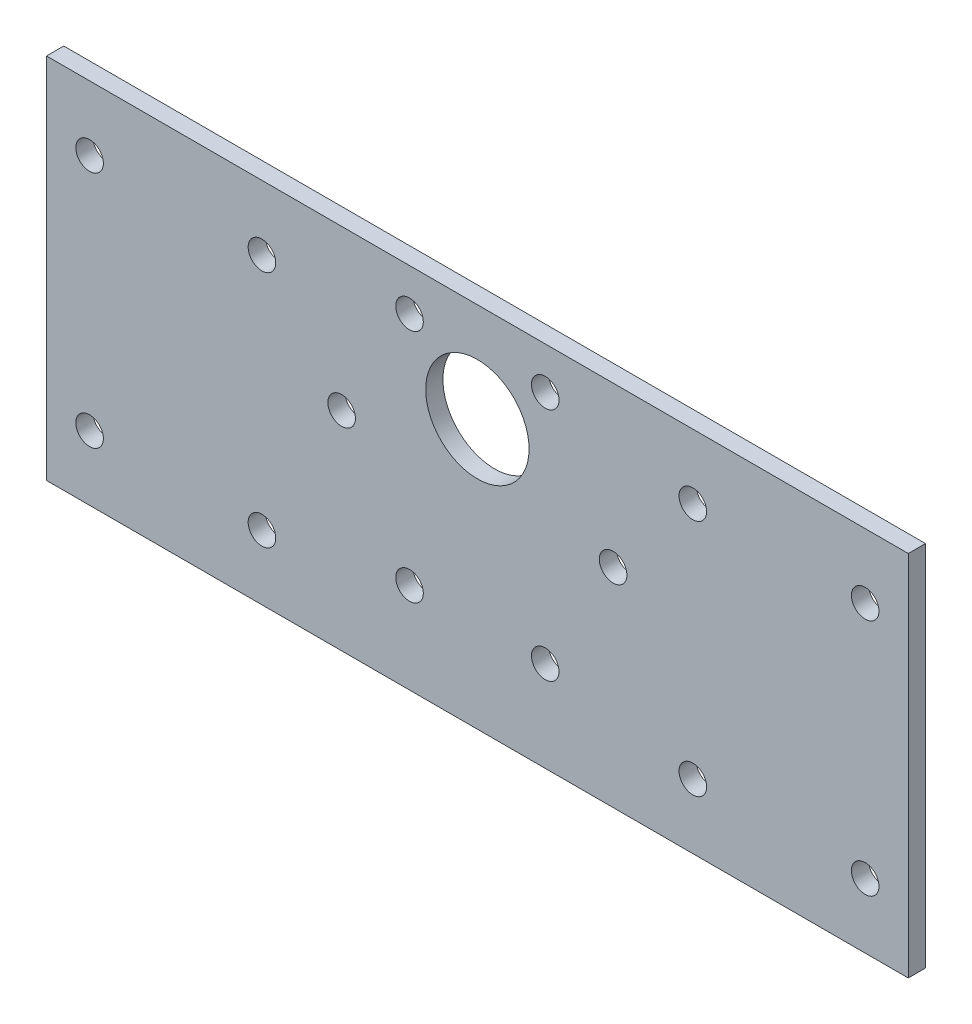
ISO-10303-21;
HEADER;
FILE_DESCRIPTION(('STEP AP214'),'2;1');
FILE_NAME('part.step','',(''),(''),'','','');
FILE_SCHEMA(('AUTOMOTIVE_DESIGN { 1 0 10303 214 1 1 1 1 }'));
ENDSEC;
DATA;
#1=APPLICATION_CONTEXT('core data for automotive mechanical design processes');
#2=APPLICATION_PROTOCOL_DEFINITION('international standard','automotive_design',2000,#1);
#3=PRODUCT_CONTEXT('',#1,'mechanical');
#4=PRODUCT('Part','Part','',(#3));
#5=PRODUCT_RELATED_PRODUCT_CATEGORY('part','',(#4));
#6=PRODUCT_DEFINITION_FORMATION('','',#4);
#7=PRODUCT_DEFINITION_CONTEXT('part definition',#1,'design');
#8=PRODUCT_DEFINITION('design','',#6,#7);
#9=PRODUCT_DEFINITION_SHAPE('','',#8);
#10=(LENGTH_UNIT() NAMED_UNIT(*) SI_UNIT(.MILLI.,.METRE.));
#11=(NAMED_UNIT(*) PLANE_ANGLE_UNIT() SI_UNIT($,.RADIAN.));
#12=(NAMED_UNIT(*) SI_UNIT($,.STERADIAN.) SOLID_ANGLE_UNIT());
#13=UNCERTAINTY_MEASURE_WITH_UNIT(LENGTH_MEASURE(1.E-05),#10,'distance_accuracy_value','');
#14=(GEOMETRIC_REPRESENTATION_CONTEXT(3) GLOBAL_UNCERTAINTY_ASSIGNED_CONTEXT((#13)) GLOBAL_UNIT_ASSIGNED_CONTEXT((#10,
#11,#12)) REPRESENTATION_CONTEXT('',''));
#15=CARTESIAN_POINT('',(0.,0.,0.));
#16=DIRECTION('',(0.,0.,1.));
#17=DIRECTION('',(1.,0.,0.));
#18=AXIS2_PLACEMENT_3D('',#15,#16,#17);
#19=CARTESIAN_POINT('',(-50.,0.,2.));
#20=DIRECTION('',(1.,0.,0.));
#21=DIRECTION('',(0.,1.,0.));
#22=AXIS2_PLACEMENT_3D('',#19,#20,#21);
#23=PLANE('',#22);
#24=DIRECTION('',(0.,0.,-1.));
#25=VECTOR('',#24,1.);
#26=CARTESIAN_POINT('',(-50.,-17.66,2.));
#27=LINE('',#26,#25);
#28=CARTESIAN_POINT('',(-50.,-17.66,2.));
#29=VERTEX_POINT('',#28);
#30=CARTESIAN_POINT('',(-50.,-17.66,0.));
#31=VERTEX_POINT('',#30);
#32=EDGE_CURVE('E196',#29,#31,#27,.T.);
#33=ORIENTED_EDGE('',*,*,#32,.F.);
#34=DIRECTION('',(0.,-1.,0.));
#35=VECTOR('',#34,1.);
#36=CARTESIAN_POINT('',(-50.,0.,2.));
#37=LINE('',#36,#35);
#38=CARTESIAN_POINT('',(-50.,25.,2.));
#39=VERTEX_POINT('',#38);
#40=EDGE_CURVE('E104',#39,#29,#37,.T.);
#41=ORIENTED_EDGE('',*,*,#40,.F.);
#42=DIRECTION('',(0.,0.,-1.));
#43=VECTOR('',#42,1.);
#44=CARTESIAN_POINT('',(-50.,25.,2.));
#45=LINE('',#44,#43);
#46=CARTESIAN_POINT('',(-50.,25.,0.));
#47=VERTEX_POINT('',#46);
#48=EDGE_CURVE('E73',#39,#47,#45,.T.);
#49=ORIENTED_EDGE('',*,*,#48,.T.);
#50=DIRECTION('',(0.,-1.,0.));
#51=VECTOR('',#50,1.);
#52=CARTESIAN_POINT('',(-50.,0.,0.));
#53=LINE('',#52,#51);
#54=EDGE_CURVE('E102',#47,#31,#53,.T.);
#55=ORIENTED_EDGE('',*,*,#54,.T.);
#56=EDGE_LOOP('',(#33,#41,#49,#55));
#57=FACE_BOUND('',#56,.T.);
#58=ADVANCED_FACE('F65',(#57),#23,.F.);
#59=CARTESIAN_POINT('',(50.,0.,2.));
#60=DIRECTION('',(1.,0.,0.));
#61=DIRECTION('',(0.,1.,0.));
#62=AXIS2_PLACEMENT_3D('',#59,#60,#61);
#63=PLANE('',#62);
#64=DIRECTION('',(0.,-1.,0.));
#65=VECTOR('',#64,1.);
#66=CARTESIAN_POINT('',(50.,0.,2.));
#67=LINE('',#66,#65);
#68=CARTESIAN_POINT('',(50.,25.,2.));
#69=VERTEX_POINT('',#68);
#70=CARTESIAN_POINT('',(50.,-17.66,2.));
#71=VERTEX_POINT('',#70);
#72=EDGE_CURVE('E131',#69,#71,#67,.T.);
#73=ORIENTED_EDGE('',*,*,#72,.T.);
#74=DIRECTION('',(0.,0.,1.));
#75=VECTOR('',#74,1.);
#76=CARTESIAN_POINT('',(50.,-17.66,2.));
#77=LINE('',#76,#75);
#78=CARTESIAN_POINT('',(50.,-17.66,0.));
#79=VERTEX_POINT('',#78);
#80=EDGE_CURVE('E80',#79,#71,#77,.T.);
#81=ORIENTED_EDGE('',*,*,#80,.F.);
#82=DIRECTION('',(0.,-1.,0.));
#83=VECTOR('',#82,1.);
#84=CARTESIAN_POINT('',(50.,0.,0.));
#85=LINE('',#84,#83);
#86=CARTESIAN_POINT('',(50.,25.,0.));
#87=VERTEX_POINT('',#86);
#88=EDGE_CURVE('E117',#87,#79,#85,.T.);
#89=ORIENTED_EDGE('',*,*,#88,.F.);
#90=DIRECTION('',(0.,0.,-1.));
#91=VECTOR('',#90,1.);
#92=CARTESIAN_POINT('',(50.,25.,2.));
#93=LINE('',#92,#91);
#94=EDGE_CURVE('E12',#69,#87,#93,.T.);
#95=ORIENTED_EDGE('',*,*,#94,.F.);
#96=EDGE_LOOP('',(#73,#81,#89,#95));
#97=FACE_BOUND('',#96,.T.);
#98=ADVANCED_FACE('F262',(#97),#63,.T.);
#99=CARTESIAN_POINT('',(0.,0.,0.));
#100=DIRECTION('',(0.,0.,1.));
#101=DIRECTION('',(1.,0.,0.));
#102=AXIS2_PLACEMENT_3D('',#99,#100,#101);
#103=PLANE('',#102);
#104=CARTESIAN_POINT('',(45.,17.5,0.));
#105=DIRECTION('',(0.,0.,1.));
#106=DIRECTION('',(1.,0.,0.));
#107=AXIS2_PLACEMENT_3D('',#104,#105,#106);
#108=CIRCLE('',#107,1.6);
#109=CARTESIAN_POINT('',(46.6,17.5,0.));
#110=VERTEX_POINT('',#109);
#111=EDGE_CURVE('E199',#110,#110,#108,.T.);
#112=ORIENTED_EDGE('',*,*,#111,.T.);
#113=EDGE_LOOP('',(#112));
#114=FACE_BOUND('',#113,.T.);
#115=CARTESIAN_POINT('',(-45.,17.5,0.));
#116=DIRECTION('',(0.,0.,1.));
#117=DIRECTION('',(1.,0.,0.));
#118=AXIS2_PLACEMENT_3D('',#115,#116,#117);
#119=CIRCLE('',#118,1.6);
#120=CARTESIAN_POINT('',(-43.4,17.5,0.));
#121=VERTEX_POINT('',#120);
#122=EDGE_CURVE('E202',#121,#121,#119,.T.);
#123=ORIENTED_EDGE('',*,*,#122,.T.);
#124=EDGE_LOOP('',(#123));
#125=FACE_BOUND('',#124,.T.);
#126=CARTESIAN_POINT('',(-25.,17.5,0.));
#127=DIRECTION('',(0.,0.,1.));
#128=DIRECTION('',(1.,0.,0.));
#129=AXIS2_PLACEMENT_3D('',#126,#127,#128);
#130=CIRCLE('',#129,1.6);
#131=CARTESIAN_POINT('',(-23.4,17.5,0.));
#132=VERTEX_POINT('',#131);
#133=EDGE_CURVE('E205',#132,#132,#130,.T.);
#134=ORIENTED_EDGE('',*,*,#133,.T.);
#135=EDGE_LOOP('',(#134));
#136=FACE_BOUND('',#135,.T.);
#137=CARTESIAN_POINT('',(25.,17.5,0.));
#138=DIRECTION('',(0.,0.,1.));
#139=DIRECTION('',(1.,0.,0.));
#140=AXIS2_PLACEMENT_3D('',#137,#138,#139);
#141=CIRCLE('',#140,1.6);
#142=CARTESIAN_POINT('',(26.6,17.5,0.));
#143=VERTEX_POINT('',#142);
#144=EDGE_CURVE('E208',#143,#143,#141,.T.);
#145=ORIENTED_EDGE('',*,*,#144,.T.);
#146=EDGE_LOOP('',(#145));
#147=FACE_BOUND('',#146,.T.);
#148=CARTESIAN_POINT('',(-15.75,6.5,0.));
#149=DIRECTION('',(0.,0.,1.));
#150=DIRECTION('',(1.,0.,0.));
#151=AXIS2_PLACEMENT_3D('',#148,#149,#150);
#152=CIRCLE('',#151,1.6);
#153=CARTESIAN_POINT('',(-14.15,6.5,0.));
#154=VERTEX_POINT('',#153);
#155=EDGE_CURVE('E119',#154,#154,#152,.T.);
#156=ORIENTED_EDGE('',*,*,#155,.T.);
#157=EDGE_LOOP('',(#156));
#158=FACE_BOUND('',#157,.T.);
#159=CARTESIAN_POINT('',(15.75,6.5,0.));
#160=DIRECTION('',(0.,0.,1.));
#161=DIRECTION('',(1.,0.,0.));
#162=AXIS2_PLACEMENT_3D('',#159,#160,#161);
#163=CIRCLE('',#162,1.6);
#164=CARTESIAN_POINT('',(17.35,6.5,0.));
#165=VERTEX_POINT('',#164);
#166=EDGE_CURVE('E124',#165,#165,#163,.T.);
#167=ORIENTED_EDGE('',*,*,#166,.T.);
#168=EDGE_LOOP('',(#167));
#169=FACE_BOUND('',#168,.T.);
#170=CARTESIAN_POINT('',(0.,13.5,0.));
#171=DIRECTION('',(0.,0.,1.));
#172=DIRECTION('',(1.,0.,0.));
#173=AXIS2_PLACEMENT_3D('',#170,#171,#172);
#174=CIRCLE('',#173,6.);
#175=CARTESIAN_POINT('',(6.,13.5,0.));
#176=VERTEX_POINT('',#175);
#177=EDGE_CURVE('E127',#176,#176,#174,.T.);
#178=ORIENTED_EDGE('',*,*,#177,.T.);
#179=EDGE_LOOP('',(#178));
#180=FACE_BOUND('',#179,.T.);
#181=CARTESIAN_POINT('',(-7.87499999999997,20.1399001096049,0.));
#182=DIRECTION('',(0.,0.,1.));
#183=DIRECTION('',(1.,0.,0.));
#184=AXIS2_PLACEMENT_3D('',#181,#182,#183);
#185=CIRCLE('',#184,1.6);
#186=CARTESIAN_POINT('',(-6.27499999999997,20.1399001096049,0.));
#187=VERTEX_POINT('',#186);
#188=EDGE_CURVE('E142',#187,#187,#185,.T.);
#189=ORIENTED_EDGE('',*,*,#188,.T.);
#190=EDGE_LOOP('',(#189));
#191=FACE_BOUND('',#190,.T.);
#192=CARTESIAN_POINT('',(7.87500000000006,20.1399001096049,0.));
#193=DIRECTION('',(0.,0.,1.));
#194=DIRECTION('',(1.,0.,0.));
#195=AXIS2_PLACEMENT_3D('',#192,#193,#194);
#196=CIRCLE('',#195,1.6);
#197=CARTESIAN_POINT('',(9.47500000000007,20.1399001096049,0.));
#198=VERTEX_POINT('',#197);
#199=EDGE_CURVE('E148',#198,#198,#196,.T.);
#200=ORIENTED_EDGE('',*,*,#199,.T.);
#201=EDGE_LOOP('',(#200));
#202=FACE_BOUND('',#201,.T.);
#203=CARTESIAN_POINT('',(7.87500000000007,-7.13990010960487,0.));
#204=DIRECTION('',(0.,0.,1.));
#205=DIRECTION('',(1.,0.,0.));
#206=AXIS2_PLACEMENT_3D('',#203,#204,#205);
#207=CIRCLE('',#206,1.6);
#208=CARTESIAN_POINT('',(9.47500000000007,-7.13990010960487,0.));
#209=VERTEX_POINT('',#208);
#210=EDGE_CURVE('E161',#209,#209,#207,.T.);
#211=ORIENTED_EDGE('',*,*,#210,.T.);
#212=EDGE_LOOP('',(#211));
#213=FACE_BOUND('',#212,.T.);
#214=CARTESIAN_POINT('',(-7.87499999999996,-7.13990010960493,0.));
#215=DIRECTION('',(0.,0.,1.));
#216=DIRECTION('',(1.,0.,0.));
#217=AXIS2_PLACEMENT_3D('',#214,#215,#216);
#218=CIRCLE('',#217,1.6);
#219=CARTESIAN_POINT('',(-6.27499999999996,-7.13990010960493,0.));
#220=VERTEX_POINT('',#219);
#221=EDGE_CURVE('E154',#220,#220,#218,.T.);
#222=ORIENTED_EDGE('',*,*,#221,.T.);
#223=EDGE_LOOP('',(#222));
#224=FACE_BOUND('',#223,.T.);
#225=CARTESIAN_POINT('',(-25.,-10.16,0.));
#226=DIRECTION('',(0.,0.,1.));
#227=DIRECTION('',(1.,0.,0.));
#228=AXIS2_PLACEMENT_3D('',#225,#226,#227);
#229=CIRCLE('',#228,1.6);
#230=CARTESIAN_POINT('',(-23.4,-10.16,0.));
#231=VERTEX_POINT('',#230);
#232=EDGE_CURVE('E179',#231,#231,#229,.T.);
#233=ORIENTED_EDGE('',*,*,#232,.T.);
#234=EDGE_LOOP('',(#233));
#235=FACE_BOUND('',#234,.T.);
#236=CARTESIAN_POINT('',(45.,-10.16,0.));
#237=DIRECTION('',(0.,0.,1.));
#238=DIRECTION('',(1.,0.,0.));
#239=AXIS2_PLACEMENT_3D('',#236,#237,#238);
#240=CIRCLE('',#239,1.6);
#241=CARTESIAN_POINT('',(46.6,-10.16,0.));
#242=VERTEX_POINT('',#241);
#243=EDGE_CURVE('E172',#242,#242,#240,.T.);
#244=ORIENTED_EDGE('',*,*,#243,.T.);
#245=EDGE_LOOP('',(#244));
#246=FACE_BOUND('',#245,.T.);
#247=CARTESIAN_POINT('',(25.,-10.16,0.));
#248=DIRECTION('',(0.,0.,1.));
#249=DIRECTION('',(1.,0.,0.));
#250=AXIS2_PLACEMENT_3D('',#247,#248,#249);
#251=CIRCLE('',#250,1.6);
#252=CARTESIAN_POINT('',(26.6,-10.16,0.));
#253=VERTEX_POINT('',#252);
#254=EDGE_CURVE('E173',#253,#253,#251,.T.);
#255=ORIENTED_EDGE('',*,*,#254,.T.);
#256=EDGE_LOOP('',(#255));
#257=FACE_BOUND('',#256,.T.);
#258=CARTESIAN_POINT('',(-45.,-10.16,0.));
#259=DIRECTION('',(0.,0.,1.));
#260=DIRECTION('',(1.,0.,0.));
#261=AXIS2_PLACEMENT_3D('',#258,#259,#260);
#262=CIRCLE('',#261,1.6);
#263=CARTESIAN_POINT('',(-43.4,-10.16,0.));
#264=VERTEX_POINT('',#263);
#265=EDGE_CURVE('E155',#264,#264,#262,.T.);
#266=ORIENTED_EDGE('',*,*,#265,.T.);
#267=EDGE_LOOP('',(#266));
#268=FACE_BOUND('',#267,.T.);
#269=DIRECTION('',(1.,0.,0.));
#270=VECTOR('',#269,1.);
#271=CARTESIAN_POINT('',(-50.,-17.66,0.));
#272=LINE('',#271,#270);
#273=EDGE_CURVE('E112',#31,#79,#272,.T.);
#274=ORIENTED_EDGE('',*,*,#273,.F.);
#275=ORIENTED_EDGE('',*,*,#54,.F.);
#276=DIRECTION('',(1.,0.,0.));
#277=VECTOR('',#276,1.);
#278=CARTESIAN_POINT('',(0.,25.,0.));
#279=LINE('',#278,#277);
#280=EDGE_CURVE('E111',#47,#87,#279,.T.);
#281=ORIENTED_EDGE('',*,*,#280,.T.);
#282=ORIENTED_EDGE('',*,*,#88,.T.);
#283=EDGE_LOOP('',(#274,#275,#281,#282));
#284=FACE_BOUND('',#283,.T.);
#285=ADVANCED_FACE('F109',(#114,#125,#136,#147,#158,#169,#180,#191,#202,#213,#224,#235,#246,
#257,#268,#284),#103,.F.);
#286=CARTESIAN_POINT('',(0.,0.,2.));
#287=DIRECTION('',(0.,0.,1.));
#288=DIRECTION('',(1.,0.,0.));
#289=AXIS2_PLACEMENT_3D('',#286,#287,#288);
#290=PLANE('',#289);
#291=CARTESIAN_POINT('',(45.,17.5,2.));
#292=DIRECTION('',(0.,0.,1.));
#293=DIRECTION('',(1.,0.,0.));
#294=AXIS2_PLACEMENT_3D('',#291,#292,#293);
#295=CIRCLE('',#294,1.6);
#296=CARTESIAN_POINT('',(46.6,17.5,2.));
#297=VERTEX_POINT('',#296);
#298=EDGE_CURVE('E214',#297,#297,#295,.T.);
#299=ORIENTED_EDGE('',*,*,#298,.F.);
#300=EDGE_LOOP('',(#299));
#301=FACE_BOUND('',#300,.T.);
#302=CARTESIAN_POINT('',(-45.,17.5,2.));
#303=DIRECTION('',(0.,0.,1.));
#304=DIRECTION('',(1.,0.,0.));
#305=AXIS2_PLACEMENT_3D('',#302,#303,#304);
#306=CIRCLE('',#305,1.6);
#307=CARTESIAN_POINT('',(-43.4,17.5,2.));
#308=VERTEX_POINT('',#307);
#309=EDGE_CURVE('E215',#308,#308,#306,.T.);
#310=ORIENTED_EDGE('',*,*,#309,.F.);
#311=EDGE_LOOP('',(#310));
#312=FACE_BOUND('',#311,.T.);
#313=CARTESIAN_POINT('',(-25.,17.5,2.));
#314=DIRECTION('',(0.,0.,1.));
#315=DIRECTION('',(1.,0.,0.));
#316=AXIS2_PLACEMENT_3D('',#313,#314,#315);
#317=CIRCLE('',#316,1.6);
#318=CARTESIAN_POINT('',(-23.4,17.5,2.));
#319=VERTEX_POINT('',#318);
#320=EDGE_CURVE('E218',#319,#319,#317,.T.);
#321=ORIENTED_EDGE('',*,*,#320,.F.);
#322=EDGE_LOOP('',(#321));
#323=FACE_BOUND('',#322,.T.);
#324=CARTESIAN_POINT('',(25.,17.5,2.));
#325=DIRECTION('',(0.,0.,1.));
#326=DIRECTION('',(1.,0.,0.));
#327=AXIS2_PLACEMENT_3D('',#324,#325,#326);
#328=CIRCLE('',#327,1.6);
#329=CARTESIAN_POINT('',(26.6,17.5,2.));
#330=VERTEX_POINT('',#329);
#331=EDGE_CURVE('E211',#330,#330,#328,.T.);
#332=ORIENTED_EDGE('',*,*,#331,.F.);
#333=EDGE_LOOP('',(#332));
#334=FACE_BOUND('',#333,.T.);
#335=CARTESIAN_POINT('',(-45.,-10.16,2.));
#336=DIRECTION('',(0.,0.,1.));
#337=DIRECTION('',(1.,0.,0.));
#338=AXIS2_PLACEMENT_3D('',#335,#336,#337);
#339=CIRCLE('',#338,1.6);
#340=CARTESIAN_POINT('',(-43.4,-10.16,2.));
#341=VERTEX_POINT('',#340);
#342=EDGE_CURVE('E182',#341,#341,#339,.T.);
#343=ORIENTED_EDGE('',*,*,#342,.F.);
#344=EDGE_LOOP('',(#343));
#345=FACE_BOUND('',#344,.T.);
#346=CARTESIAN_POINT('',(25.,-10.16,2.));
#347=DIRECTION('',(0.,0.,1.));
#348=DIRECTION('',(1.,0.,0.));
#349=AXIS2_PLACEMENT_3D('',#346,#347,#348);
#350=CIRCLE('',#349,1.6);
#351=CARTESIAN_POINT('',(26.6,-10.16,2.));
#352=VERTEX_POINT('',#351);
#353=EDGE_CURVE('E183',#352,#352,#350,.T.);
#354=ORIENTED_EDGE('',*,*,#353,.F.);
#355=EDGE_LOOP('',(#354));
#356=FACE_BOUND('',#355,.T.);
#357=CARTESIAN_POINT('',(45.,-10.16,2.));
#358=DIRECTION('',(0.,0.,1.));
#359=DIRECTION('',(1.,0.,0.));
#360=AXIS2_PLACEMENT_3D('',#357,#358,#359);
#361=CIRCLE('',#360,1.6);
#362=CARTESIAN_POINT('',(46.6,-10.16,2.));
#363=VERTEX_POINT('',#362);
#364=EDGE_CURVE('E169',#363,#363,#361,.T.);
#365=ORIENTED_EDGE('',*,*,#364,.F.);
#366=EDGE_LOOP('',(#365));
#367=FACE_BOUND('',#366,.T.);
#368=CARTESIAN_POINT('',(-25.,-10.16,2.));
#369=DIRECTION('',(0.,0.,1.));
#370=DIRECTION('',(1.,0.,0.));
#371=AXIS2_PLACEMENT_3D('',#368,#369,#370);
#372=CIRCLE('',#371,1.6);
#373=CARTESIAN_POINT('',(-23.4,-10.16,2.));
#374=VERTEX_POINT('',#373);
#375=EDGE_CURVE('E176',#374,#374,#372,.T.);
#376=ORIENTED_EDGE('',*,*,#375,.F.);
#377=EDGE_LOOP('',(#376));
#378=FACE_BOUND('',#377,.T.);
#379=CARTESIAN_POINT('',(-7.87499999999996,-7.13990010960493,2.));
#380=DIRECTION('',(0.,0.,1.));
#381=DIRECTION('',(1.,0.,0.));
#382=AXIS2_PLACEMENT_3D('',#379,#380,#381);
#383=CIRCLE('',#382,1.6);
#384=CARTESIAN_POINT('',(-6.27499999999996,-7.13990010960493,2.));
#385=VERTEX_POINT('',#384);
#386=EDGE_CURVE('E151',#385,#385,#383,.T.);
#387=ORIENTED_EDGE('',*,*,#386,.F.);
#388=EDGE_LOOP('',(#387));
#389=FACE_BOUND('',#388,.T.);
#390=CARTESIAN_POINT('',(7.87500000000007,-7.13990010960487,2.));
#391=DIRECTION('',(0.,0.,1.));
#392=DIRECTION('',(1.,0.,0.));
#393=AXIS2_PLACEMENT_3D('',#390,#391,#392);
#394=CIRCLE('',#393,1.6);
#395=CARTESIAN_POINT('',(9.47500000000007,-7.13990010960487,2.));
#396=VERTEX_POINT('',#395);
#397=EDGE_CURVE('E158',#396,#396,#394,.T.);
#398=ORIENTED_EDGE('',*,*,#397,.F.);
#399=EDGE_LOOP('',(#398));
#400=FACE_BOUND('',#399,.T.);
#401=CARTESIAN_POINT('',(7.87500000000006,20.1399001096049,2.));
#402=DIRECTION('',(0.,0.,1.));
#403=DIRECTION('',(1.,0.,0.));
#404=AXIS2_PLACEMENT_3D('',#401,#402,#403);
#405=CIRCLE('',#404,1.6);
#406=CARTESIAN_POINT('',(9.47500000000007,20.1399001096049,2.));
#407=VERTEX_POINT('',#406);
#408=EDGE_CURVE('E164',#407,#407,#405,.T.);
#409=ORIENTED_EDGE('',*,*,#408,.F.);
#410=EDGE_LOOP('',(#409));
#411=FACE_BOUND('',#410,.T.);
#412=CARTESIAN_POINT('',(-7.87499999999997,20.1399001096049,2.));
#413=DIRECTION('',(0.,0.,1.));
#414=DIRECTION('',(1.,0.,0.));
#415=AXIS2_PLACEMENT_3D('',#412,#413,#414);
#416=CIRCLE('',#415,1.6);
#417=CARTESIAN_POINT('',(-6.27499999999997,20.1399001096049,2.));
#418=VERTEX_POINT('',#417);
#419=EDGE_CURVE('E145',#418,#418,#416,.T.);
#420=ORIENTED_EDGE('',*,*,#419,.F.);
#421=EDGE_LOOP('',(#420));
#422=FACE_BOUND('',#421,.T.);
#423=CARTESIAN_POINT('',(0.,13.5,2.));
#424=DIRECTION('',(0.,0.,1.));
#425=DIRECTION('',(1.,0.,0.));
#426=AXIS2_PLACEMENT_3D('',#423,#424,#425);
#427=CIRCLE('',#426,6.);
#428=CARTESIAN_POINT('',(6.,13.5,2.));
#429=VERTEX_POINT('',#428);
#430=EDGE_CURVE('E139',#429,#429,#427,.T.);
#431=ORIENTED_EDGE('',*,*,#430,.F.);
#432=EDGE_LOOP('',(#431));
#433=FACE_BOUND('',#432,.T.);
#434=CARTESIAN_POINT('',(15.75,6.5,2.));
#435=DIRECTION('',(0.,0.,1.));
#436=DIRECTION('',(1.,0.,0.));
#437=AXIS2_PLACEMENT_3D('',#434,#435,#436);
#438=CIRCLE('',#437,1.6);
#439=CARTESIAN_POINT('',(17.35,6.5,2.));
#440=VERTEX_POINT('',#439);
#441=EDGE_CURVE('E113',#440,#440,#438,.T.);
#442=ORIENTED_EDGE('',*,*,#441,.F.);
#443=EDGE_LOOP('',(#442));
#444=FACE_BOUND('',#443,.T.);
#445=CARTESIAN_POINT('',(-15.75,6.5,2.));
#446=DIRECTION('',(0.,0.,1.));
#447=DIRECTION('',(1.,0.,0.));
#448=AXIS2_PLACEMENT_3D('',#445,#446,#447);
#449=CIRCLE('',#448,1.6);
#450=CARTESIAN_POINT('',(-14.15,6.5,2.));
#451=VERTEX_POINT('',#450);
#452=EDGE_CURVE('E134',#451,#451,#449,.T.);
#453=ORIENTED_EDGE('',*,*,#452,.F.);
#454=EDGE_LOOP('',(#453));
#455=FACE_BOUND('',#454,.T.);
#456=ORIENTED_EDGE('',*,*,#40,.T.);
#457=DIRECTION('',(-1.,0.,0.));
#458=VECTOR('',#457,1.);
#459=CARTESIAN_POINT('',(-50.,-17.66,2.));
#460=LINE('',#459,#458);
#461=EDGE_CURVE('E186',#71,#29,#460,.T.);
#462=ORIENTED_EDGE('',*,*,#461,.F.);
#463=ORIENTED_EDGE('',*,*,#72,.F.);
#464=DIRECTION('',(1.,0.,0.));
#465=VECTOR('',#464,1.);
#466=CARTESIAN_POINT('',(0.,25.,2.));
#467=LINE('',#466,#465);
#468=EDGE_CURVE('E129',#39,#69,#467,.T.);
#469=ORIENTED_EDGE('',*,*,#468,.F.);
#470=EDGE_LOOP('',(#456,#462,#463,#469));
#471=FACE_BOUND('',#470,.T.);
#472=ADVANCED_FACE('F227',(#301,#312,#323,#334,#345,#356,#367,#378,#389,#400,#411,#422,#433,
#444,#455,#471),#290,.T.);
#473=CARTESIAN_POINT('',(0.,25.,2.));
#474=DIRECTION('',(0.,1.,0.));
#475=DIRECTION('',(0.,0.,1.));
#476=AXIS2_PLACEMENT_3D('',#473,#474,#475);
#477=PLANE('',#476);
#478=ORIENTED_EDGE('',*,*,#280,.F.);
#479=ORIENTED_EDGE('',*,*,#48,.F.);
#480=ORIENTED_EDGE('',*,*,#468,.T.);
#481=ORIENTED_EDGE('',*,*,#94,.T.);
#482=EDGE_LOOP('',(#478,#479,#480,#481));
#483=FACE_BOUND('',#482,.T.);
#484=ADVANCED_FACE('F115',(#483),#477,.T.);
#485=CARTESIAN_POINT('',(-15.75,6.5,2.));
#486=DIRECTION('',(0.,0.,-1.));
#487=DIRECTION('',(-1.,0.,0.));
#488=AXIS2_PLACEMENT_3D('',#485,#486,#487);
#489=CYLINDRICAL_SURFACE('',#488,1.6);
#490=ORIENTED_EDGE('',*,*,#452,.T.);
#491=EDGE_LOOP('',(#490));
#492=FACE_BOUND('',#491,.T.);
#493=ORIENTED_EDGE('',*,*,#155,.F.);
#494=EDGE_LOOP('',(#493));
#495=FACE_BOUND('',#494,.T.);
#496=ADVANCED_FACE('F273',(#492,#495),#489,.F.);
#497=CARTESIAN_POINT('',(15.75,6.5,2.));
#498=DIRECTION('',(0.,0.,-1.));
#499=DIRECTION('',(-1.,0.,0.));
#500=AXIS2_PLACEMENT_3D('',#497,#498,#499);
#501=CYLINDRICAL_SURFACE('',#500,1.6);
#502=ORIENTED_EDGE('',*,*,#441,.T.);
#503=EDGE_LOOP('',(#502));
#504=FACE_BOUND('',#503,.T.);
#505=ORIENTED_EDGE('',*,*,#166,.F.);
#506=EDGE_LOOP('',(#505));
#507=FACE_BOUND('',#506,.T.);
#508=ADVANCED_FACE('F67',(#504,#507),#501,.F.);
#509=CARTESIAN_POINT('',(0.,13.5,0.));
#510=DIRECTION('',(0.,0.,1.));
#511=DIRECTION('',(1.,0.,0.));
#512=AXIS2_PLACEMENT_3D('',#509,#510,#511);
#513=CYLINDRICAL_SURFACE('',#512,6.);
#514=ORIENTED_EDGE('',*,*,#177,.F.);
#515=EDGE_LOOP('',(#514));
#516=FACE_BOUND('',#515,.T.);
#517=ORIENTED_EDGE('',*,*,#430,.T.);
#518=EDGE_LOOP('',(#517));
#519=FACE_BOUND('',#518,.T.);
#520=ADVANCED_FACE('F280',(#516,#519),#513,.F.);
#521=CARTESIAN_POINT('',(-7.87499999999997,20.1399001096049,0.));
#522=DIRECTION('',(0.,0.,1.));
#523=DIRECTION('',(1.,0.,0.));
#524=AXIS2_PLACEMENT_3D('',#521,#522,#523);
#525=CYLINDRICAL_SURFACE('',#524,1.6);
#526=ORIENTED_EDGE('',*,*,#188,.F.);
#527=EDGE_LOOP('',(#526));
#528=FACE_BOUND('',#527,.T.);
#529=ORIENTED_EDGE('',*,*,#419,.T.);
#530=EDGE_LOOP('',(#529));
#531=FACE_BOUND('',#530,.T.);
#532=ADVANCED_FACE('F334',(#528,#531),#525,.F.);
#533=CARTESIAN_POINT('',(7.87500000000006,20.1399001096049,0.));
#534=DIRECTION('',(0.,0.,1.));
#535=DIRECTION('',(1.,0.,0.));
#536=AXIS2_PLACEMENT_3D('',#533,#534,#535);
#537=CYLINDRICAL_SURFACE('',#536,1.6);
#538=ORIENTED_EDGE('',*,*,#199,.F.);
#539=EDGE_LOOP('',(#538));
#540=FACE_BOUND('',#539,.T.);
#541=ORIENTED_EDGE('',*,*,#408,.T.);
#542=EDGE_LOOP('',(#541));
#543=FACE_BOUND('',#542,.T.);
#544=ADVANCED_FACE('F330',(#540,#543),#537,.F.);
#545=CARTESIAN_POINT('',(7.87500000000007,-7.13990010960487,0.));
#546=DIRECTION('',(0.,0.,1.));
#547=DIRECTION('',(1.,0.,0.));
#548=AXIS2_PLACEMENT_3D('',#545,#546,#547);
#549=CYLINDRICAL_SURFACE('',#548,1.6);
#550=ORIENTED_EDGE('',*,*,#210,.F.);
#551=EDGE_LOOP('',(#550));
#552=FACE_BOUND('',#551,.T.);
#553=ORIENTED_EDGE('',*,*,#397,.T.);
#554=EDGE_LOOP('',(#553));
#555=FACE_BOUND('',#554,.T.);
#556=ADVANCED_FACE('F333',(#552,#555),#549,.F.);
#557=CARTESIAN_POINT('',(-7.87499999999996,-7.13990010960493,0.));
#558=DIRECTION('',(0.,0.,1.));
#559=DIRECTION('',(1.,0.,0.));
#560=AXIS2_PLACEMENT_3D('',#557,#558,#559);
#561=CYLINDRICAL_SURFACE('',#560,1.6);
#562=ORIENTED_EDGE('',*,*,#221,.F.);
#563=EDGE_LOOP('',(#562));
#564=FACE_BOUND('',#563,.T.);
#565=ORIENTED_EDGE('',*,*,#386,.T.);
#566=EDGE_LOOP('',(#565));
#567=FACE_BOUND('',#566,.T.);
#568=ADVANCED_FACE('F325',(#564,#567),#561,.F.);
#569=CARTESIAN_POINT('',(-25.,-10.16,0.));
#570=DIRECTION('',(0.,0.,1.));
#571=DIRECTION('',(1.,0.,0.));
#572=AXIS2_PLACEMENT_3D('',#569,#570,#571);
#573=CYLINDRICAL_SURFACE('',#572,1.6);
#574=ORIENTED_EDGE('',*,*,#232,.F.);
#575=EDGE_LOOP('',(#574));
#576=FACE_BOUND('',#575,.T.);
#577=ORIENTED_EDGE('',*,*,#375,.T.);
#578=EDGE_LOOP('',(#577));
#579=FACE_BOUND('',#578,.T.);
#580=ADVANCED_FACE('F322',(#576,#579),#573,.F.);
#581=CARTESIAN_POINT('',(45.,-10.16,0.));
#582=DIRECTION('',(0.,0.,1.));
#583=DIRECTION('',(1.,0.,0.));
#584=AXIS2_PLACEMENT_3D('',#581,#582,#583);
#585=CYLINDRICAL_SURFACE('',#584,1.6);
#586=ORIENTED_EDGE('',*,*,#243,.F.);
#587=EDGE_LOOP('',(#586));
#588=FACE_BOUND('',#587,.T.);
#589=ORIENTED_EDGE('',*,*,#364,.T.);
#590=EDGE_LOOP('',(#589));
#591=FACE_BOUND('',#590,.T.);
#592=ADVANCED_FACE('F317',(#588,#591),#585,.F.);
#593=CARTESIAN_POINT('',(25.,-10.16,0.));
#594=DIRECTION('',(0.,0.,1.));
#595=DIRECTION('',(1.,0.,0.));
#596=AXIS2_PLACEMENT_3D('',#593,#594,#595);
#597=CYLINDRICAL_SURFACE('',#596,1.6);
#598=ORIENTED_EDGE('',*,*,#254,.F.);
#599=EDGE_LOOP('',(#598));
#600=FACE_BOUND('',#599,.T.);
#601=ORIENTED_EDGE('',*,*,#353,.T.);
#602=EDGE_LOOP('',(#601));
#603=FACE_BOUND('',#602,.T.);
#604=ADVANCED_FACE('F309',(#600,#603),#597,.F.);
#605=CARTESIAN_POINT('',(-45.,-10.16,0.));
#606=DIRECTION('',(0.,0.,1.));
#607=DIRECTION('',(1.,0.,0.));
#608=AXIS2_PLACEMENT_3D('',#605,#606,#607);
#609=CYLINDRICAL_SURFACE('',#608,1.6);
#610=ORIENTED_EDGE('',*,*,#265,.F.);
#611=EDGE_LOOP('',(#610));
#612=FACE_BOUND('',#611,.T.);
#613=ORIENTED_EDGE('',*,*,#342,.T.);
#614=EDGE_LOOP('',(#613));
#615=FACE_BOUND('',#614,.T.);
#616=ADVANCED_FACE('F306',(#612,#615),#609,.F.);
#617=CARTESIAN_POINT('',(0.,-17.66,0.));
#618=DIRECTION('',(0.,-1.,0.));
#619=DIRECTION('',(0.,0.,-1.));
#620=AXIS2_PLACEMENT_3D('',#617,#618,#619);
#621=PLANE('',#620);
#622=ORIENTED_EDGE('',*,*,#32,.T.);
#623=ORIENTED_EDGE('',*,*,#273,.T.);
#624=ORIENTED_EDGE('',*,*,#80,.T.);
#625=ORIENTED_EDGE('',*,*,#461,.T.);
#626=EDGE_LOOP('',(#622,#623,#624,#625));
#627=FACE_BOUND('',#626,.T.);
#628=ADVANCED_FACE('F260',(#627),#621,.T.);
#629=CARTESIAN_POINT('',(25.,17.5,-8.));
#630=DIRECTION('',(0.,0.,1.));
#631=DIRECTION('',(1.,0.,0.));
#632=AXIS2_PLACEMENT_3D('',#629,#630,#631);
#633=CYLINDRICAL_SURFACE('',#632,1.6);
#634=ORIENTED_EDGE('',*,*,#331,.T.);
#635=EDGE_LOOP('',(#634));
#636=FACE_BOUND('',#635,.T.);
#637=ORIENTED_EDGE('',*,*,#144,.F.);
#638=EDGE_LOOP('',(#637));
#639=FACE_BOUND('',#638,.T.);
#640=ADVANCED_FACE('F315',(#636,#639),#633,.F.);
#641=CARTESIAN_POINT('',(-25.,17.5,-8.));
#642=DIRECTION('',(0.,0.,1.));
#643=DIRECTION('',(1.,0.,0.));
#644=AXIS2_PLACEMENT_3D('',#641,#642,#643);
#645=CYLINDRICAL_SURFACE('',#644,1.6);
#646=ORIENTED_EDGE('',*,*,#320,.T.);
#647=EDGE_LOOP('',(#646));
#648=FACE_BOUND('',#647,.T.);
#649=ORIENTED_EDGE('',*,*,#133,.F.);
#650=EDGE_LOOP('',(#649));
#651=FACE_BOUND('',#650,.T.);
#652=ADVANCED_FACE('F224',(#648,#651),#645,.F.);
#653=CARTESIAN_POINT('',(-45.,17.5,-8.));
#654=DIRECTION('',(0.,0.,1.));
#655=DIRECTION('',(1.,0.,0.));
#656=AXIS2_PLACEMENT_3D('',#653,#654,#655);
#657=CYLINDRICAL_SURFACE('',#656,1.6);
#658=ORIENTED_EDGE('',*,*,#309,.T.);
#659=EDGE_LOOP('',(#658));
#660=FACE_BOUND('',#659,.T.);
#661=ORIENTED_EDGE('',*,*,#122,.F.);
#662=EDGE_LOOP('',(#661));
#663=FACE_BOUND('',#662,.T.);
#664=ADVANCED_FACE('F429',(#660,#663),#657,.F.);
#665=CARTESIAN_POINT('',(45.,17.5,-8.));
#666=DIRECTION('',(0.,0.,1.));
#667=DIRECTION('',(1.,0.,0.));
#668=AXIS2_PLACEMENT_3D('',#665,#666,#667);
#669=CYLINDRICAL_SURFACE('',#668,1.6);
#670=ORIENTED_EDGE('',*,*,#298,.T.);
#671=EDGE_LOOP('',(#670));
#672=FACE_BOUND('',#671,.T.);
#673=ORIENTED_EDGE('',*,*,#111,.F.);
#674=EDGE_LOOP('',(#673));
#675=FACE_BOUND('',#674,.T.);
#676=ADVANCED_FACE('F438',(#672,#675),#669,.F.);
#677=CLOSED_SHELL('',(#58,#98,#285,#472,#484,#496,#508,#520,#532,#544,#556,#568,#580,#592,#604,
#616,#628,#640,#652,#664,#676));
#678=MANIFOLD_SOLID_BREP('B2',#677);
#679=ADVANCED_BREP_SHAPE_REPRESENTATION('',(#18,#678),#14);
#680=SHAPE_DEFINITION_REPRESENTATION(#9,#679);
ENDSEC;
END-ISO-10303-21;
